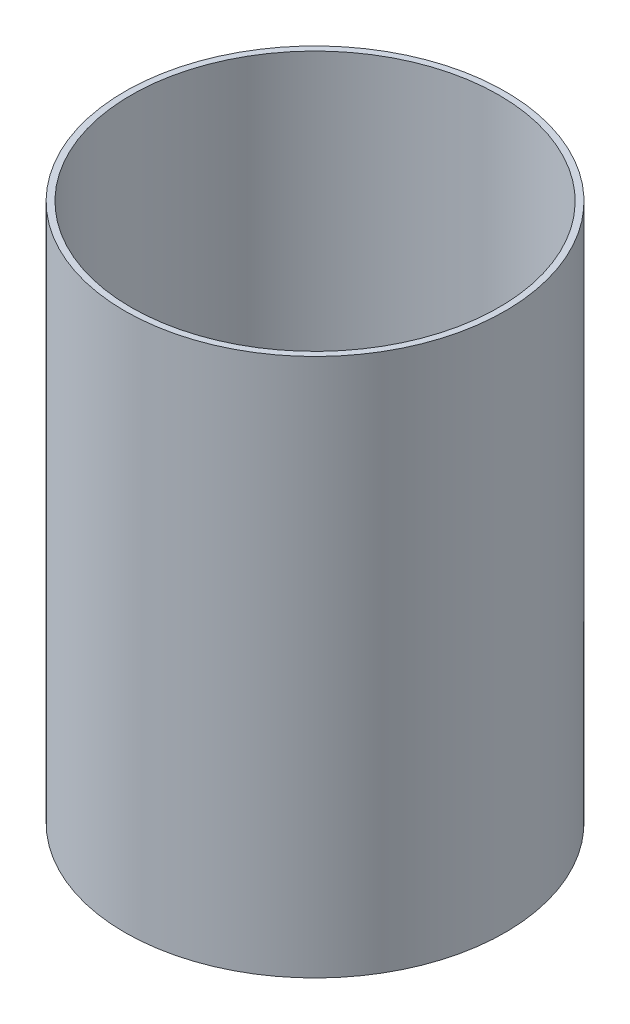
ISO-10303-21;
HEADER;
FILE_DESCRIPTION(('STEP AP214'),'2;1');
FILE_NAME('part.step','',(''),(''),'','','');
FILE_SCHEMA(('AUTOMOTIVE_DESIGN { 1 0 10303 214 1 1 1 1 }'));
ENDSEC;
DATA;
#1=APPLICATION_CONTEXT('core data for automotive mechanical design processes');
#2=APPLICATION_PROTOCOL_DEFINITION('international standard','automotive_design',2000,#1);
#3=PRODUCT_CONTEXT('',#1,'mechanical');
#4=PRODUCT('Part','Part','',(#3));
#5=PRODUCT_RELATED_PRODUCT_CATEGORY('part','',(#4));
#6=PRODUCT_DEFINITION_FORMATION('','',#4);
#7=PRODUCT_DEFINITION_CONTEXT('part definition',#1,'design');
#8=PRODUCT_DEFINITION('design','',#6,#7);
#9=PRODUCT_DEFINITION_SHAPE('','',#8);
#10=(LENGTH_UNIT() NAMED_UNIT(*) SI_UNIT(.MILLI.,.METRE.));
#11=(NAMED_UNIT(*) PLANE_ANGLE_UNIT() SI_UNIT($,.RADIAN.));
#12=(NAMED_UNIT(*) SI_UNIT($,.STERADIAN.) SOLID_ANGLE_UNIT());
#13=UNCERTAINTY_MEASURE_WITH_UNIT(LENGTH_MEASURE(1.E-05),#10,'distance_accuracy_value','');
#14=(GEOMETRIC_REPRESENTATION_CONTEXT(3) GLOBAL_UNCERTAINTY_ASSIGNED_CONTEXT((#13)) GLOBAL_UNIT_ASSIGNED_CONTEXT((#10,
#11,#12)) REPRESENTATION_CONTEXT('',''));
#15=CARTESIAN_POINT('',(0.,0.,0.));
#16=DIRECTION('',(0.,0.,1.));
#17=DIRECTION('',(1.,0.,0.));
#18=AXIS2_PLACEMENT_3D('',#15,#16,#17);
#19=CARTESIAN_POINT('',(0.,3.302,0.));
#20=DIRECTION('',(0.,1.,0.));
#21=DIRECTION('',(0.,0.,1.));
#22=AXIS2_PLACEMENT_3D('',#19,#20,#21);
#23=PLANE('',#22);
#24=CARTESIAN_POINT('',(-26.112352144,3.30200000000003,57.3248386784275));
#25=DIRECTION('',(0.,1.,0.));
#26=DIRECTION('',(0.,0.,1.));
#27=AXIS2_PLACEMENT_3D('',#24,#25,#26);
#28=CIRCLE('',#27,5.08);
#29=CARTESIAN_POINT('',(-26.112352144,3.30200000000003,62.4048386784275));
#30=VERTEX_POINT('',#29);
#31=EDGE_CURVE('E113',#30,#30,#28,.T.);
#32=ORIENTED_EDGE('',*,*,#31,.F.);
#33=EDGE_LOOP('',(#32));
#34=FACE_BOUND('',#33,.T.);
#35=CARTESIAN_POINT('',(9.193647856,3.30200000000003,61.0334508536087));
#36=DIRECTION('',(0.,1.,0.));
#37=DIRECTION('',(0.,0.,1.));
#38=AXIS2_PLACEMENT_3D('',#35,#36,#37);
#39=CIRCLE('',#38,5.08);
#40=CARTESIAN_POINT('',(9.193647856,3.30200000000003,66.1134508536087));
#41=VERTEX_POINT('',#40);
#42=EDGE_CURVE('E123',#41,#41,#39,.T.);
#43=ORIENTED_EDGE('',*,*,#42,.F.);
#44=EDGE_LOOP('',(#43));
#45=FACE_BOUND('',#44,.T.);
#46=CARTESIAN_POINT('',(38.1,3.30200000000003,-65.9911357683742));
#47=DIRECTION('',(0.,1.,0.));
#48=DIRECTION('',(0.,0.,1.));
#49=AXIS2_PLACEMENT_3D('',#46,#47,#48);
#50=CIRCLE('',#49,3.81);
#51=CARTESIAN_POINT('',(38.1,3.30200000000003,-62.1811357683742));
#52=VERTEX_POINT('',#51);
#53=EDGE_CURVE('E81',#52,#52,#50,.T.);
#54=ORIENTED_EDGE('',*,*,#53,.F.);
#55=EDGE_LOOP('',(#54));
#56=FACE_BOUND('',#55,.T.);
#57=CARTESIAN_POINT('',(-38.1,3.30200000000003,-65.9911357683742));
#58=DIRECTION('',(0.,1.,0.));
#59=DIRECTION('',(0.,0.,1.));
#60=AXIS2_PLACEMENT_3D('',#57,#58,#59);
#61=CIRCLE('',#60,3.81);
#62=CARTESIAN_POINT('',(-38.1,3.30200000000003,-62.1811357683742));
#63=VERTEX_POINT('',#62);
#64=EDGE_CURVE('E91',#63,#63,#61,.T.);
#65=ORIENTED_EDGE('',*,*,#64,.F.);
#66=EDGE_LOOP('',(#65));
#67=FACE_BOUND('',#66,.T.);
#68=CARTESIAN_POINT('',(-38.1,3.30200000000003,65.9911357683742));
#69=DIRECTION('',(0.,1.,0.));
#70=DIRECTION('',(0.,0.,1.));
#71=AXIS2_PLACEMENT_3D('',#68,#69,#70);
#72=CIRCLE('',#71,3.81);
#73=CARTESIAN_POINT('',(-38.1,3.30200000000003,69.8011357683742));
#74=VERTEX_POINT('',#73);
#75=EDGE_CURVE('E95',#74,#74,#72,.T.);
#76=ORIENTED_EDGE('',*,*,#75,.F.);
#77=EDGE_LOOP('',(#76));
#78=FACE_BOUND('',#77,.T.);
#79=CARTESIAN_POINT('',(38.1,3.30200000000003,65.9911357683742));
#80=DIRECTION('',(0.,1.,0.));
#81=DIRECTION('',(0.,0.,1.));
#82=AXIS2_PLACEMENT_3D('',#79,#80,#81);
#83=CIRCLE('',#82,3.81);
#84=CARTESIAN_POINT('',(38.1,3.30200000000003,69.8011357683742));
#85=VERTEX_POINT('',#84);
#86=EDGE_CURVE('E99',#85,#85,#83,.T.);
#87=ORIENTED_EDGE('',*,*,#86,.F.);
#88=EDGE_LOOP('',(#87));
#89=FACE_BOUND('',#88,.T.);
#90=CARTESIAN_POINT('',(-75.565,3.302,0.));
#91=DIRECTION('',(0.,1.,0.));
#92=DIRECTION('',(0.,0.,1.));
#93=AXIS2_PLACEMENT_3D('',#90,#91,#92);
#94=CIRCLE('',#93,13.97);
#95=CARTESIAN_POINT('',(-75.565,3.302,13.97));
#96=VERTEX_POINT('',#95);
#97=EDGE_CURVE('E71',#96,#96,#94,.F.);
#98=ORIENTED_EDGE('',*,*,#97,.T.);
#99=EDGE_LOOP('',(#98));
#100=FACE_BOUND('',#99,.T.);
#101=CARTESIAN_POINT('',(75.565,3.302,0.));
#102=DIRECTION('',(0.,1.,0.));
#103=DIRECTION('',(0.,0.,1.));
#104=AXIS2_PLACEMENT_3D('',#101,#102,#103);
#105=CIRCLE('',#104,13.97);
#106=CARTESIAN_POINT('',(75.565,3.302,13.97));
#107=VERTEX_POINT('',#106);
#108=EDGE_CURVE('E72',#107,#107,#105,.F.);
#109=ORIENTED_EDGE('',*,*,#108,.T.);
#110=EDGE_LOOP('',(#109));
#111=FACE_BOUND('',#110,.T.);
#112=CARTESIAN_POINT('',(0.,3.302,0.));
#113=DIRECTION('',(0.,1.,0.));
#114=DIRECTION('',(0.,0.,1.));
#115=AXIS2_PLACEMENT_3D('',#112,#113,#114);
#116=CIRCLE('',#115,53.975);
#117=CARTESIAN_POINT('',(0.,3.302,53.975));
#118=VERTEX_POINT('',#117);
#119=EDGE_CURVE('E52',#118,#118,#116,.T.);
#120=ORIENTED_EDGE('',*,*,#119,.F.);
#121=EDGE_LOOP('',(#120));
#122=FACE_BOUND('',#121,.T.);
#123=CARTESIAN_POINT('',(0.,3.30200000000003,0.));
#124=DIRECTION('',(0.,1.,0.));
#125=DIRECTION('',(0.,0.,1.));
#126=AXIS2_PLACEMENT_3D('',#123,#124,#125);
#127=CIRCLE('',#126,89.662);
#128=CARTESIAN_POINT('',(0.,3.30200000000003,89.662));
#129=VERTEX_POINT('',#128);
#130=EDGE_CURVE('E10',#129,#129,#127,.F.);
#131=ORIENTED_EDGE('',*,*,#130,.F.);
#132=EDGE_LOOP('',(#131));
#133=FACE_BOUND('',#132,.T.);
#134=ADVANCED_FACE('F39',(#34,#45,#56,#67,#78,#89,#100,#111,#122,#133),#23,.T.);
#135=CARTESIAN_POINT('',(0.,0.,0.));
#136=DIRECTION('',(0.,1.,0.));
#137=DIRECTION('',(0.,0.,1.));
#138=AXIS2_PLACEMENT_3D('',#135,#136,#137);
#139=PLANE('',#138);
#140=CARTESIAN_POINT('',(-26.112352144,0.,57.3248386784275));
#141=DIRECTION('',(0.,-1.,0.));
#142=DIRECTION('',(0.,0.,-1.));
#143=AXIS2_PLACEMENT_3D('',#140,#141,#142);
#144=CIRCLE('',#143,5.08);
#145=CARTESIAN_POINT('',(-26.112352144,0.,52.2448386784275));
#146=VERTEX_POINT('',#145);
#147=EDGE_CURVE('E127',#146,#146,#144,.T.);
#148=ORIENTED_EDGE('',*,*,#147,.F.);
#149=EDGE_LOOP('',(#148));
#150=FACE_BOUND('',#149,.T.);
#151=CARTESIAN_POINT('',(9.193647856,0.,61.0334508536087));
#152=DIRECTION('',(0.,-1.,0.));
#153=DIRECTION('',(0.,0.,-1.));
#154=AXIS2_PLACEMENT_3D('',#151,#152,#153);
#155=CIRCLE('',#154,5.08);
#156=CARTESIAN_POINT('',(9.193647856,0.,55.9534508536087));
#157=VERTEX_POINT('',#156);
#158=EDGE_CURVE('E128',#157,#157,#155,.T.);
#159=ORIENTED_EDGE('',*,*,#158,.F.);
#160=EDGE_LOOP('',(#159));
#161=FACE_BOUND('',#160,.T.);
#162=CARTESIAN_POINT('',(38.1,0.,-65.9911357683742));
#163=DIRECTION('',(0.,-1.,0.));
#164=DIRECTION('',(0.,0.,-1.));
#165=AXIS2_PLACEMENT_3D('',#162,#163,#164);
#166=CIRCLE('',#165,3.81);
#167=CARTESIAN_POINT('',(38.1,0.,-69.8011357683742));
#168=VERTEX_POINT('',#167);
#169=EDGE_CURVE('E108',#168,#168,#166,.T.);
#170=ORIENTED_EDGE('',*,*,#169,.F.);
#171=EDGE_LOOP('',(#170));
#172=FACE_BOUND('',#171,.T.);
#173=CARTESIAN_POINT('',(-38.1,0.,-65.9911357683742));
#174=DIRECTION('',(0.,-1.,0.));
#175=DIRECTION('',(0.,0.,-1.));
#176=AXIS2_PLACEMENT_3D('',#173,#174,#175);
#177=CIRCLE('',#176,3.81);
#178=CARTESIAN_POINT('',(-38.1,0.,-69.8011357683742));
#179=VERTEX_POINT('',#178);
#180=EDGE_CURVE('E112',#179,#179,#177,.T.);
#181=ORIENTED_EDGE('',*,*,#180,.F.);
#182=EDGE_LOOP('',(#181));
#183=FACE_BOUND('',#182,.T.);
#184=CARTESIAN_POINT('',(-38.1,0.,65.9911357683742));
#185=DIRECTION('',(0.,-1.,0.));
#186=DIRECTION('',(0.,0.,-1.));
#187=AXIS2_PLACEMENT_3D('',#184,#185,#186);
#188=CIRCLE('',#187,3.81);
#189=CARTESIAN_POINT('',(-38.1,0.,62.1811357683742));
#190=VERTEX_POINT('',#189);
#191=EDGE_CURVE('E107',#190,#190,#188,.T.);
#192=ORIENTED_EDGE('',*,*,#191,.F.);
#193=EDGE_LOOP('',(#192));
#194=FACE_BOUND('',#193,.T.);
#195=CARTESIAN_POINT('',(38.1,0.,65.9911357683742));
#196=DIRECTION('',(0.,-1.,0.));
#197=DIRECTION('',(0.,0.,-1.));
#198=AXIS2_PLACEMENT_3D('',#195,#196,#197);
#199=CIRCLE('',#198,3.81);
#200=CARTESIAN_POINT('',(38.1,0.,62.1811357683742));
#201=VERTEX_POINT('',#200);
#202=EDGE_CURVE('E103',#201,#201,#199,.T.);
#203=ORIENTED_EDGE('',*,*,#202,.F.);
#204=EDGE_LOOP('',(#203));
#205=FACE_BOUND('',#204,.T.);
#206=CARTESIAN_POINT('',(-75.565,0.,0.));
#207=DIRECTION('',(0.,-1.,0.));
#208=DIRECTION('',(0.,0.,-1.));
#209=AXIS2_PLACEMENT_3D('',#206,#207,#208);
#210=CIRCLE('',#209,13.97);
#211=CARTESIAN_POINT('',(-75.565,0.,-13.97));
#212=VERTEX_POINT('',#211);
#213=EDGE_CURVE('E76',#212,#212,#210,.T.);
#214=ORIENTED_EDGE('',*,*,#213,.F.);
#215=EDGE_LOOP('',(#214));
#216=FACE_BOUND('',#215,.T.);
#217=CARTESIAN_POINT('',(75.565,0.,0.));
#218=DIRECTION('',(0.,-1.,0.));
#219=DIRECTION('',(0.,0.,1.));
#220=AXIS2_PLACEMENT_3D('',#217,#218,#219);
#221=CIRCLE('',#220,13.97);
#222=CARTESIAN_POINT('',(75.565,0.,13.97));
#223=VERTEX_POINT('',#222);
#224=EDGE_CURVE('E77',#223,#223,#221,.T.);
#225=ORIENTED_EDGE('',*,*,#224,.F.);
#226=EDGE_LOOP('',(#225));
#227=FACE_BOUND('',#226,.T.);
#228=CARTESIAN_POINT('',(0.,0.,0.));
#229=DIRECTION('',(0.,1.,0.));
#230=DIRECTION('',(0.,0.,1.));
#231=AXIS2_PLACEMENT_3D('',#228,#229,#230);
#232=CIRCLE('',#231,92.71);
#233=CARTESIAN_POINT('',(0.,0.,92.71));
#234=VERTEX_POINT('',#233);
#235=EDGE_CURVE('E47',#234,#234,#232,.T.);
#236=ORIENTED_EDGE('',*,*,#235,.F.);
#237=EDGE_LOOP('',(#236));
#238=FACE_BOUND('',#237,.T.);
#239=CARTESIAN_POINT('',(0.,0.,0.));
#240=DIRECTION('',(0.,1.,0.));
#241=DIRECTION('',(0.,0.,1.));
#242=AXIS2_PLACEMENT_3D('',#239,#240,#241);
#243=CIRCLE('',#242,53.975);
#244=CARTESIAN_POINT('',(0.,0.,53.975));
#245=VERTEX_POINT('',#244);
#246=EDGE_CURVE('E57',#245,#245,#243,.T.);
#247=ORIENTED_EDGE('',*,*,#246,.T.);
#248=EDGE_LOOP('',(#247));
#249=FACE_BOUND('',#248,.T.);
#250=ADVANCED_FACE('F138',(#150,#161,#172,#183,#194,#205,#216,#227,#238,#249),#139,.F.);
#251=CARTESIAN_POINT('',(0.,3.302,0.));
#252=DIRECTION('',(0.,-1.,0.));
#253=DIRECTION('',(0.,0.,-1.));
#254=AXIS2_PLACEMENT_3D('',#251,#252,#253);
#255=CYLINDRICAL_SURFACE('',#254,92.71);
#256=ORIENTED_EDGE('',*,*,#235,.T.);
#257=EDGE_LOOP('',(#256));
#258=FACE_BOUND('',#257,.T.);
#259=CARTESIAN_POINT('',(0.,262.382,0.));
#260=DIRECTION('',(0.,1.,0.));
#261=DIRECTION('',(0.,0.,1.));
#262=AXIS2_PLACEMENT_3D('',#259,#260,#261);
#263=CIRCLE('',#262,92.71);
#264=CARTESIAN_POINT('',(0.,262.382,92.71));
#265=VERTEX_POINT('',#264);
#266=EDGE_CURVE('E62',#265,#265,#263,.T.);
#267=ORIENTED_EDGE('',*,*,#266,.F.);
#268=EDGE_LOOP('',(#267));
#269=FACE_BOUND('',#268,.T.);
#270=ADVANCED_FACE('F41',(#258,#269),#255,.T.);
#271=CARTESIAN_POINT('',(0.,3.302,0.));
#272=DIRECTION('',(0.,-1.,0.));
#273=DIRECTION('',(0.,0.,-1.));
#274=AXIS2_PLACEMENT_3D('',#271,#272,#273);
#275=CYLINDRICAL_SURFACE('',#274,53.975);
#276=ORIENTED_EDGE('',*,*,#119,.T.);
#277=EDGE_LOOP('',(#276));
#278=FACE_BOUND('',#277,.T.);
#279=ORIENTED_EDGE('',*,*,#246,.F.);
#280=EDGE_LOOP('',(#279));
#281=FACE_BOUND('',#280,.T.);
#282=ADVANCED_FACE('F158',(#278,#281),#275,.F.);
#283=CARTESIAN_POINT('',(0.,262.382,0.));
#284=DIRECTION('',(0.,1.,0.));
#285=DIRECTION('',(0.,0.,1.));
#286=AXIS2_PLACEMENT_3D('',#283,#284,#285);
#287=PLANE('',#286);
#288=ORIENTED_EDGE('',*,*,#266,.T.);
#289=EDGE_LOOP('',(#288));
#290=FACE_BOUND('',#289,.T.);
#291=CARTESIAN_POINT('',(0.,262.382,0.));
#292=DIRECTION('',(0.,1.,0.));
#293=DIRECTION('',(0.,0.,1.));
#294=AXIS2_PLACEMENT_3D('',#291,#292,#293);
#295=CIRCLE('',#294,89.662);
#296=CARTESIAN_POINT('',(0.,262.382,89.662));
#297=VERTEX_POINT('',#296);
#298=EDGE_CURVE('E67',#297,#297,#295,.T.);
#299=ORIENTED_EDGE('',*,*,#298,.F.);
#300=EDGE_LOOP('',(#299));
#301=FACE_BOUND('',#300,.T.);
#302=ADVANCED_FACE('F160',(#290,#301),#287,.T.);
#303=CARTESIAN_POINT('',(0.,262.382,0.));
#304=DIRECTION('',(0.,-1.,0.));
#305=DIRECTION('',(0.,0.,-1.));
#306=AXIS2_PLACEMENT_3D('',#303,#304,#305);
#307=CYLINDRICAL_SURFACE('',#306,89.662);
#308=ORIENTED_EDGE('',*,*,#298,.T.);
#309=EDGE_LOOP('',(#308));
#310=FACE_BOUND('',#309,.T.);
#311=ORIENTED_EDGE('',*,*,#130,.T.);
#312=EDGE_LOOP('',(#311));
#313=FACE_BOUND('',#312,.T.);
#314=ADVANCED_FACE('F167',(#310,#313),#307,.F.);
#315=CARTESIAN_POINT('',(75.565,42.8151269327043,0.));
#316=DIRECTION('',(0.,-1.,0.));
#317=DIRECTION('',(0.,0.,-1.));
#318=AXIS2_PLACEMENT_3D('',#315,#316,#317);
#319=CYLINDRICAL_SURFACE('',#318,13.97);
#320=ORIENTED_EDGE('',*,*,#224,.T.);
#321=EDGE_LOOP('',(#320));
#322=FACE_BOUND('',#321,.T.);
#323=ORIENTED_EDGE('',*,*,#108,.F.);
#324=EDGE_LOOP('',(#323));
#325=FACE_BOUND('',#324,.T.);
#326=ADVANCED_FACE('F194',(#322,#325),#319,.F.);
#327=CARTESIAN_POINT('',(-75.565,42.8151269327043,0.));
#328=DIRECTION('',(0.,-1.,0.));
#329=DIRECTION('',(0.,0.,-1.));
#330=AXIS2_PLACEMENT_3D('',#327,#328,#329);
#331=CYLINDRICAL_SURFACE('',#330,13.97);
#332=ORIENTED_EDGE('',*,*,#213,.T.);
#333=EDGE_LOOP('',(#332));
#334=FACE_BOUND('',#333,.T.);
#335=ORIENTED_EDGE('',*,*,#97,.F.);
#336=EDGE_LOOP('',(#335));
#337=FACE_BOUND('',#336,.T.);
#338=ADVANCED_FACE('F196',(#334,#337),#331,.F.);
#339=CARTESIAN_POINT('',(38.1,262.382,65.9911357683742));
#340=DIRECTION('',(0.,-1.,0.));
#341=DIRECTION('',(0.,0.,-1.));
#342=AXIS2_PLACEMENT_3D('',#339,#340,#341);
#343=CYLINDRICAL_SURFACE('',#342,3.81);
#344=ORIENTED_EDGE('',*,*,#86,.T.);
#345=EDGE_LOOP('',(#344));
#346=FACE_BOUND('',#345,.T.);
#347=ORIENTED_EDGE('',*,*,#202,.T.);
#348=EDGE_LOOP('',(#347));
#349=FACE_BOUND('',#348,.T.);
#350=ADVANCED_FACE('F203',(#346,#349),#343,.F.);
#351=CARTESIAN_POINT('',(-38.1,262.382,65.9911357683742));
#352=DIRECTION('',(0.,-1.,0.));
#353=DIRECTION('',(0.,0.,-1.));
#354=AXIS2_PLACEMENT_3D('',#351,#352,#353);
#355=CYLINDRICAL_SURFACE('',#354,3.81);
#356=ORIENTED_EDGE('',*,*,#75,.T.);
#357=EDGE_LOOP('',(#356));
#358=FACE_BOUND('',#357,.T.);
#359=ORIENTED_EDGE('',*,*,#191,.T.);
#360=EDGE_LOOP('',(#359));
#361=FACE_BOUND('',#360,.T.);
#362=ADVANCED_FACE('F211',(#358,#361),#355,.F.);
#363=CARTESIAN_POINT('',(-38.1,262.382,-65.9911357683742));
#364=DIRECTION('',(0.,-1.,0.));
#365=DIRECTION('',(0.,0.,-1.));
#366=AXIS2_PLACEMENT_3D('',#363,#364,#365);
#367=CYLINDRICAL_SURFACE('',#366,3.81);
#368=ORIENTED_EDGE('',*,*,#64,.T.);
#369=EDGE_LOOP('',(#368));
#370=FACE_BOUND('',#369,.T.);
#371=ORIENTED_EDGE('',*,*,#180,.T.);
#372=EDGE_LOOP('',(#371));
#373=FACE_BOUND('',#372,.T.);
#374=ADVANCED_FACE('F217',(#370,#373),#367,.F.);
#375=CARTESIAN_POINT('',(38.1,262.382,-65.9911357683742));
#376=DIRECTION('',(0.,-1.,0.));
#377=DIRECTION('',(0.,0.,-1.));
#378=AXIS2_PLACEMENT_3D('',#375,#376,#377);
#379=CYLINDRICAL_SURFACE('',#378,3.81);
#380=ORIENTED_EDGE('',*,*,#53,.T.);
#381=EDGE_LOOP('',(#380));
#382=FACE_BOUND('',#381,.T.);
#383=ORIENTED_EDGE('',*,*,#169,.T.);
#384=EDGE_LOOP('',(#383));
#385=FACE_BOUND('',#384,.T.);
#386=ADVANCED_FACE('F213',(#382,#385),#379,.F.);
#387=CARTESIAN_POINT('',(9.193647856,262.382,61.0334508536087));
#388=DIRECTION('',(0.,-1.,0.));
#389=DIRECTION('',(0.,0.,-1.));
#390=AXIS2_PLACEMENT_3D('',#387,#388,#389);
#391=CYLINDRICAL_SURFACE('',#390,5.08);
#392=ORIENTED_EDGE('',*,*,#42,.T.);
#393=EDGE_LOOP('',(#392));
#394=FACE_BOUND('',#393,.T.);
#395=ORIENTED_EDGE('',*,*,#158,.T.);
#396=EDGE_LOOP('',(#395));
#397=FACE_BOUND('',#396,.T.);
#398=ADVANCED_FACE('F216',(#394,#397),#391,.F.);
#399=CARTESIAN_POINT('',(-26.112352144,262.382,57.3248386784275));
#400=DIRECTION('',(0.,-1.,0.));
#401=DIRECTION('',(0.,0.,-1.));
#402=AXIS2_PLACEMENT_3D('',#399,#400,#401);
#403=CYLINDRICAL_SURFACE('',#402,5.08);
#404=ORIENTED_EDGE('',*,*,#31,.T.);
#405=EDGE_LOOP('',(#404));
#406=FACE_BOUND('',#405,.T.);
#407=ORIENTED_EDGE('',*,*,#147,.T.);
#408=EDGE_LOOP('',(#407));
#409=FACE_BOUND('',#408,.T.);
#410=ADVANCED_FACE('F136',(#406,#409),#403,.F.);
#411=CLOSED_SHELL('',(#134,#250,#270,#282,#302,#314,#326,#338,#350,#362,#374,#386,#398,#410));
#412=MANIFOLD_SOLID_BREP('B2',#411);
#413=ADVANCED_BREP_SHAPE_REPRESENTATION('',(#18,#412),#14);
#414=SHAPE_DEFINITION_REPRESENTATION(#9,#413);
ENDSEC;
END-ISO-10303-21;
